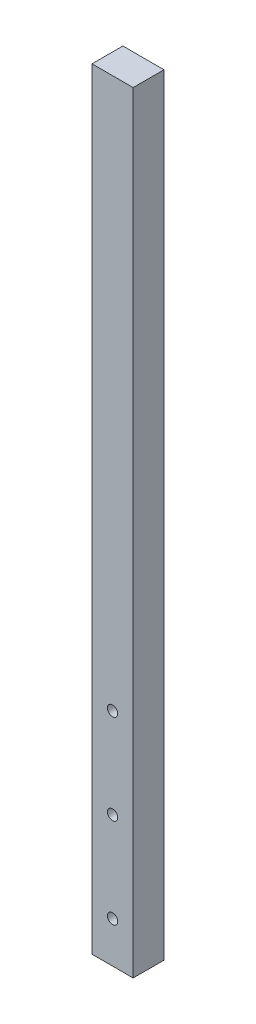
ISO-10303-21;
HEADER;
FILE_DESCRIPTION(('STEP AP214'),'2;1');
FILE_NAME('part.step','',(''),(''),'','','');
FILE_SCHEMA(('AUTOMOTIVE_DESIGN { 1 0 10303 214 1 1 1 1 }'));
ENDSEC;
DATA;
#1=APPLICATION_CONTEXT('core data for automotive mechanical design processes');
#2=APPLICATION_PROTOCOL_DEFINITION('international standard','automotive_design',2000,#1);
#3=PRODUCT_CONTEXT('',#1,'mechanical');
#4=PRODUCT('Part','Part','',(#3));
#5=PRODUCT_RELATED_PRODUCT_CATEGORY('part','',(#4));
#6=PRODUCT_DEFINITION_FORMATION('','',#4);
#7=PRODUCT_DEFINITION_CONTEXT('part definition',#1,'design');
#8=PRODUCT_DEFINITION('design','',#6,#7);
#9=PRODUCT_DEFINITION_SHAPE('','',#8);
#10=(LENGTH_UNIT() NAMED_UNIT(*) SI_UNIT(.MILLI.,.METRE.));
#11=(NAMED_UNIT(*) PLANE_ANGLE_UNIT() SI_UNIT($,.RADIAN.));
#12=(NAMED_UNIT(*) SI_UNIT($,.STERADIAN.) SOLID_ANGLE_UNIT());
#13=UNCERTAINTY_MEASURE_WITH_UNIT(LENGTH_MEASURE(1.E-05),#10,'distance_accuracy_value','');
#14=(GEOMETRIC_REPRESENTATION_CONTEXT(3) GLOBAL_UNCERTAINTY_ASSIGNED_CONTEXT((#13)) GLOBAL_UNIT_ASSIGNED_CONTEXT((#10,
#11,#12)) REPRESENTATION_CONTEXT('',''));
#15=CARTESIAN_POINT('',(0.,0.,0.));
#16=DIRECTION('',(0.,0.,1.));
#17=DIRECTION('',(1.,0.,0.));
#18=AXIS2_PLACEMENT_3D('',#15,#16,#17);
#19=CARTESIAN_POINT('',(0.,0.,6.));
#20=DIRECTION('',(0.,0.,1.));
#21=DIRECTION('',(1.,0.,0.));
#22=AXIS2_PLACEMENT_3D('',#19,#20,#21);
#23=PLANE('',#22);
#24=CARTESIAN_POINT('',(51.8216198752488,15.0133078021057,6.));
#25=DIRECTION('',(0.,0.,1.));
#26=DIRECTION('',(1.,0.,0.));
#27=AXIS2_PLACEMENT_3D('',#24,#25,#26);
#28=CIRCLE('',#27,1.);
#29=CARTESIAN_POINT('',(52.8216198752488,15.0133078021057,6.));
#30=VERTEX_POINT('',#29);
#31=EDGE_CURVE('E179',#30,#30,#28,.T.);
#32=ORIENTED_EDGE('',*,*,#31,.F.);
#33=EDGE_LOOP('',(#32));
#34=FACE_BOUND('',#33,.T.);
#35=DIRECTION('',(1.,0.,0.));
#36=VECTOR('',#35,1.);
#37=CARTESIAN_POINT('',(47.8216198752488,7.01330780210568,6.));
#38=LINE('',#37,#36);
#39=CARTESIAN_POINT('',(47.8216198752488,7.01330780210568,6.));
#40=VERTEX_POINT('',#39);
#41=CARTESIAN_POINT('',(55.8216198752488,7.01330780210568,6.));
#42=VERTEX_POINT('',#41);
#43=EDGE_CURVE('E137',#40,#42,#38,.T.);
#44=ORIENTED_EDGE('',*,*,#43,.T.);
#45=DIRECTION('',(0.,1.,0.));
#46=VECTOR('',#45,1.);
#47=CARTESIAN_POINT('',(55.8216198752488,7.01330780210568,6.));
#48=LINE('',#47,#46);
#49=CARTESIAN_POINT('',(55.8216198752488,157.013307802106,6.));
#50=VERTEX_POINT('',#49);
#51=EDGE_CURVE('E132',#42,#50,#48,.T.);
#52=ORIENTED_EDGE('',*,*,#51,.T.);
#53=DIRECTION('',(-1.,0.,0.));
#54=VECTOR('',#53,1.);
#55=CARTESIAN_POINT('',(55.8216198752488,157.013307802106,6.));
#56=LINE('',#55,#54);
#57=CARTESIAN_POINT('',(47.8216198752488,157.013307802106,6.));
#58=VERTEX_POINT('',#57);
#59=EDGE_CURVE('E135',#50,#58,#56,.T.);
#60=ORIENTED_EDGE('',*,*,#59,.T.);
#61=DIRECTION('',(0.,-1.,0.));
#62=VECTOR('',#61,1.);
#63=CARTESIAN_POINT('',(47.8216198752488,157.013307802106,6.));
#64=LINE('',#63,#62);
#65=EDGE_CURVE('E102',#58,#40,#64,.T.);
#66=ORIENTED_EDGE('',*,*,#65,.T.);
#67=EDGE_LOOP('',(#44,#52,#60,#66));
#68=FACE_BOUND('',#67,.T.);
#69=CARTESIAN_POINT('',(51.8216198752488,50.0133078021057,6.));
#70=DIRECTION('',(0.,0.,1.));
#71=DIRECTION('',(1.,0.,0.));
#72=AXIS2_PLACEMENT_3D('',#69,#70,#71);
#73=CIRCLE('',#72,1.);
#74=CARTESIAN_POINT('',(52.8216198752488,50.0133078021057,6.));
#75=VERTEX_POINT('',#74);
#76=EDGE_CURVE('E157',#75,#75,#73,.T.);
#77=ORIENTED_EDGE('',*,*,#76,.F.);
#78=EDGE_LOOP('',(#77));
#79=FACE_BOUND('',#78,.T.);
#80=CARTESIAN_POINT('',(51.8216198752488,32.5133078021057,6.));
#81=DIRECTION('',(0.,0.,1.));
#82=DIRECTION('',(1.,0.,0.));
#83=AXIS2_PLACEMENT_3D('',#80,#81,#82);
#84=CIRCLE('',#83,1.);
#85=CARTESIAN_POINT('',(52.8216198752488,32.5133078021057,6.));
#86=VERTEX_POINT('',#85);
#87=EDGE_CURVE('E187',#86,#86,#84,.T.);
#88=ORIENTED_EDGE('',*,*,#87,.F.);
#89=EDGE_LOOP('',(#88));
#90=FACE_BOUND('',#89,.T.);
#91=ADVANCED_FACE('F84',(#34,#68,#79,#90),#23,.T.);
#92=CARTESIAN_POINT('',(0.,0.,0.));
#93=DIRECTION('',(0.,0.,1.));
#94=DIRECTION('',(1.,0.,0.));
#95=AXIS2_PLACEMENT_3D('',#92,#93,#94);
#96=PLANE('',#95);
#97=DIRECTION('',(1.,0.,0.));
#98=VECTOR('',#97,1.);
#99=CARTESIAN_POINT('',(47.8216198752488,7.01330780210568,0.));
#100=LINE('',#99,#98);
#101=CARTESIAN_POINT('',(47.8216198752488,7.01330780210568,0.));
#102=VERTEX_POINT('',#101);
#103=CARTESIAN_POINT('',(55.8216198752488,7.01330780210568,0.));
#104=VERTEX_POINT('',#103);
#105=EDGE_CURVE('E153',#102,#104,#100,.T.);
#106=ORIENTED_EDGE('',*,*,#105,.F.);
#107=DIRECTION('',(0.,-1.,0.));
#108=VECTOR('',#107,1.);
#109=CARTESIAN_POINT('',(47.8216198752488,157.013307802106,0.));
#110=LINE('',#109,#108);
#111=CARTESIAN_POINT('',(47.8216198752488,157.013307802106,0.));
#112=VERTEX_POINT('',#111);
#113=EDGE_CURVE('E125',#112,#102,#110,.T.);
#114=ORIENTED_EDGE('',*,*,#113,.F.);
#115=DIRECTION('',(-1.,0.,0.));
#116=VECTOR('',#115,1.);
#117=CARTESIAN_POINT('',(55.8216198752488,157.013307802106,0.));
#118=LINE('',#117,#116);
#119=CARTESIAN_POINT('',(55.8216198752488,157.013307802106,0.));
#120=VERTEX_POINT('',#119);
#121=EDGE_CURVE('E119',#120,#112,#118,.T.);
#122=ORIENTED_EDGE('',*,*,#121,.F.);
#123=DIRECTION('',(0.,1.,0.));
#124=VECTOR('',#123,1.);
#125=CARTESIAN_POINT('',(55.8216198752488,7.01330780210568,0.));
#126=LINE('',#125,#124);
#127=EDGE_CURVE('E142',#104,#120,#126,.T.);
#128=ORIENTED_EDGE('',*,*,#127,.F.);
#129=EDGE_LOOP('',(#106,#114,#122,#128));
#130=FACE_BOUND('',#129,.T.);
#131=CARTESIAN_POINT('',(51.8216198752488,50.0133078021057,0.));
#132=DIRECTION('',(0.,0.,1.));
#133=DIRECTION('',(1.,0.,0.));
#134=AXIS2_PLACEMENT_3D('',#131,#132,#133);
#135=CIRCLE('',#134,1.);
#136=CARTESIAN_POINT('',(52.8216198752488,50.0133078021057,0.));
#137=VERTEX_POINT('',#136);
#138=EDGE_CURVE('E175',#137,#137,#135,.T.);
#139=ORIENTED_EDGE('',*,*,#138,.T.);
#140=EDGE_LOOP('',(#139));
#141=FACE_BOUND('',#140,.T.);
#142=CARTESIAN_POINT('',(51.8216198752488,15.0133078021057,0.));
#143=DIRECTION('',(0.,0.,1.));
#144=DIRECTION('',(1.,0.,0.));
#145=AXIS2_PLACEMENT_3D('',#142,#143,#144);
#146=CIRCLE('',#145,1.);
#147=CARTESIAN_POINT('',(52.8216198752488,15.0133078021057,0.));
#148=VERTEX_POINT('',#147);
#149=EDGE_CURVE('E183',#148,#148,#146,.T.);
#150=ORIENTED_EDGE('',*,*,#149,.T.);
#151=EDGE_LOOP('',(#150));
#152=FACE_BOUND('',#151,.T.);
#153=CARTESIAN_POINT('',(51.8216198752488,32.5133078021057,0.));
#154=DIRECTION('',(0.,0.,1.));
#155=DIRECTION('',(1.,0.,0.));
#156=AXIS2_PLACEMENT_3D('',#153,#154,#155);
#157=CIRCLE('',#156,1.);
#158=CARTESIAN_POINT('',(52.8216198752488,32.5133078021057,0.));
#159=VERTEX_POINT('',#158);
#160=EDGE_CURVE('E191',#159,#159,#157,.T.);
#161=ORIENTED_EDGE('',*,*,#160,.T.);
#162=EDGE_LOOP('',(#161));
#163=FACE_BOUND('',#162,.T.);
#164=ADVANCED_FACE('F170',(#130,#141,#152,#163),#96,.F.);
#165=CARTESIAN_POINT('',(47.8216198752488,7.01330780210568,6.));
#166=DIRECTION('',(0.,1.,0.));
#167=DIRECTION('',(0.,0.,1.));
#168=AXIS2_PLACEMENT_3D('',#165,#166,#167);
#169=PLANE('',#168);
#170=ORIENTED_EDGE('',*,*,#105,.T.);
#171=DIRECTION('',(0.,0.,-1.));
#172=VECTOR('',#171,1.);
#173=CARTESIAN_POINT('',(55.8216198752488,7.01330780210568,6.));
#174=LINE('',#173,#172);
#175=EDGE_CURVE('E12',#42,#104,#174,.T.);
#176=ORIENTED_EDGE('',*,*,#175,.F.);
#177=ORIENTED_EDGE('',*,*,#43,.F.);
#178=DIRECTION('',(0.,0.,-1.));
#179=VECTOR('',#178,1.);
#180=CARTESIAN_POINT('',(47.8216198752488,7.01330780210568,6.));
#181=LINE('',#180,#179);
#182=EDGE_CURVE('E149',#40,#102,#181,.T.);
#183=ORIENTED_EDGE('',*,*,#182,.T.);
#184=EDGE_LOOP('',(#170,#176,#177,#183));
#185=FACE_BOUND('',#184,.T.);
#186=ADVANCED_FACE('F86',(#185),#169,.F.);
#187=CARTESIAN_POINT('',(55.8216198752488,7.01330780210568,6.));
#188=DIRECTION('',(-1.,0.,0.));
#189=DIRECTION('',(0.,0.,1.));
#190=AXIS2_PLACEMENT_3D('',#187,#188,#189);
#191=PLANE('',#190);
#192=ORIENTED_EDGE('',*,*,#127,.T.);
#193=DIRECTION('',(0.,0.,-1.));
#194=VECTOR('',#193,1.);
#195=CARTESIAN_POINT('',(55.8216198752488,157.013307802106,6.));
#196=LINE('',#195,#194);
#197=EDGE_CURVE('E94',#50,#120,#196,.T.);
#198=ORIENTED_EDGE('',*,*,#197,.F.);
#199=ORIENTED_EDGE('',*,*,#51,.F.);
#200=ORIENTED_EDGE('',*,*,#175,.T.);
#201=EDGE_LOOP('',(#192,#198,#199,#200));
#202=FACE_BOUND('',#201,.T.);
#203=ADVANCED_FACE('F141',(#202),#191,.F.);
#204=CARTESIAN_POINT('',(55.8216198752488,157.013307802106,6.));
#205=DIRECTION('',(0.,-1.,0.));
#206=DIRECTION('',(0.,0.,-1.));
#207=AXIS2_PLACEMENT_3D('',#204,#205,#206);
#208=PLANE('',#207);
#209=ORIENTED_EDGE('',*,*,#121,.T.);
#210=DIRECTION('',(0.,0.,-1.));
#211=VECTOR('',#210,1.);
#212=CARTESIAN_POINT('',(47.8216198752488,157.013307802106,6.));
#213=LINE('',#212,#211);
#214=EDGE_CURVE('E144',#58,#112,#213,.T.);
#215=ORIENTED_EDGE('',*,*,#214,.F.);
#216=ORIENTED_EDGE('',*,*,#59,.F.);
#217=ORIENTED_EDGE('',*,*,#197,.T.);
#218=EDGE_LOOP('',(#209,#215,#216,#217));
#219=FACE_BOUND('',#218,.T.);
#220=ADVANCED_FACE('F145',(#219),#208,.F.);
#221=CARTESIAN_POINT('',(47.8216198752488,157.013307802106,6.));
#222=DIRECTION('',(1.,0.,0.));
#223=DIRECTION('',(0.,0.,-1.));
#224=AXIS2_PLACEMENT_3D('',#221,#222,#223);
#225=PLANE('',#224);
#226=ORIENTED_EDGE('',*,*,#113,.T.);
#227=ORIENTED_EDGE('',*,*,#182,.F.);
#228=ORIENTED_EDGE('',*,*,#65,.F.);
#229=ORIENTED_EDGE('',*,*,#214,.T.);
#230=EDGE_LOOP('',(#226,#227,#228,#229));
#231=FACE_BOUND('',#230,.T.);
#232=ADVANCED_FACE('F167',(#231),#225,.F.);
#233=CARTESIAN_POINT('',(51.8216198752488,50.0133078021057,6.));
#234=DIRECTION('',(0.,0.,-1.));
#235=DIRECTION('',(-1.,0.,0.));
#236=AXIS2_PLACEMENT_3D('',#233,#234,#235);
#237=CYLINDRICAL_SURFACE('',#236,1.);
#238=ORIENTED_EDGE('',*,*,#76,.T.);
#239=EDGE_LOOP('',(#238));
#240=FACE_BOUND('',#239,.T.);
#241=ORIENTED_EDGE('',*,*,#138,.F.);
#242=EDGE_LOOP('',(#241));
#243=FACE_BOUND('',#242,.T.);
#244=ADVANCED_FACE('F211',(#240,#243),#237,.F.);
#245=CARTESIAN_POINT('',(51.8216198752488,15.0133078021057,6.));
#246=DIRECTION('',(0.,0.,-1.));
#247=DIRECTION('',(-1.,0.,0.));
#248=AXIS2_PLACEMENT_3D('',#245,#246,#247);
#249=CYLINDRICAL_SURFACE('',#248,1.);
#250=ORIENTED_EDGE('',*,*,#31,.T.);
#251=EDGE_LOOP('',(#250));
#252=FACE_BOUND('',#251,.T.);
#253=ORIENTED_EDGE('',*,*,#149,.F.);
#254=EDGE_LOOP('',(#253));
#255=FACE_BOUND('',#254,.T.);
#256=ADVANCED_FACE('F257',(#252,#255),#249,.F.);
#257=CARTESIAN_POINT('',(51.8216198752488,32.5133078021057,6.));
#258=DIRECTION('',(0.,0.,-1.));
#259=DIRECTION('',(-1.,0.,0.));
#260=AXIS2_PLACEMENT_3D('',#257,#258,#259);
#261=CYLINDRICAL_SURFACE('',#260,1.);
#262=ORIENTED_EDGE('',*,*,#87,.T.);
#263=EDGE_LOOP('',(#262));
#264=FACE_BOUND('',#263,.T.);
#265=ORIENTED_EDGE('',*,*,#160,.F.);
#266=EDGE_LOOP('',(#265));
#267=FACE_BOUND('',#266,.T.);
#268=ADVANCED_FACE('F199',(#264,#267),#261,.F.);
#269=CLOSED_SHELL('',(#91,#164,#186,#203,#220,#232,#244,#256,#268));
#270=MANIFOLD_SOLID_BREP('B2',#269);
#271=ADVANCED_BREP_SHAPE_REPRESENTATION('',(#18,#270),#14);
#272=SHAPE_DEFINITION_REPRESENTATION(#9,#271);
ENDSEC;
END-ISO-10303-21;
